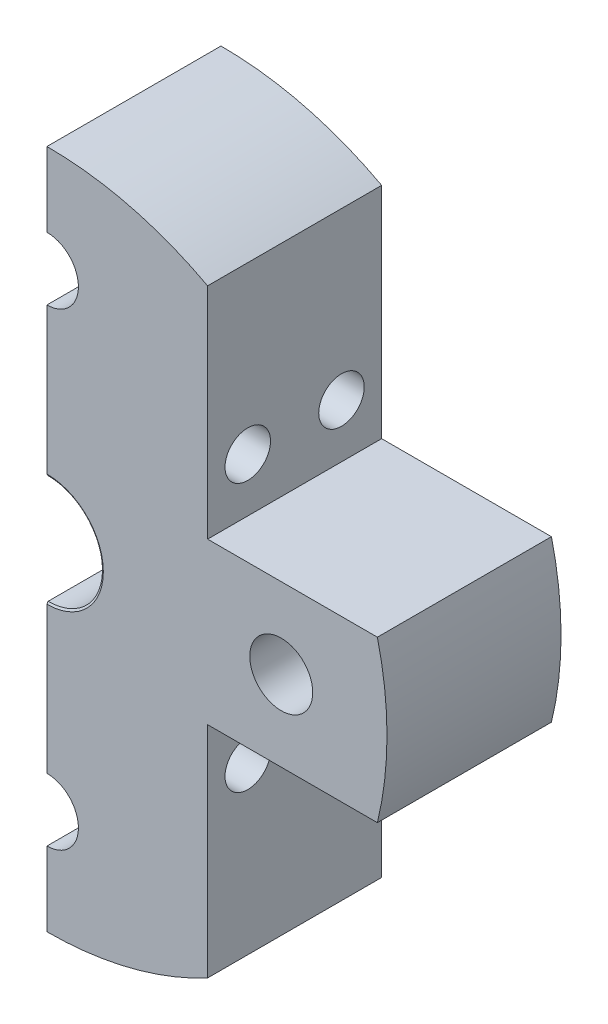
ISO-10303-21;
HEADER;
FILE_DESCRIPTION(('STEP AP214'),'2;1');
FILE_NAME('part.step','',(''),(''),'','','');
FILE_SCHEMA(('AUTOMOTIVE_DESIGN { 1 0 10303 214 1 1 1 1 }'));
ENDSEC;
DATA;
#1=APPLICATION_CONTEXT('core data for automotive mechanical design processes');
#2=APPLICATION_PROTOCOL_DEFINITION('international standard','automotive_design',2000,#1);
#3=PRODUCT_CONTEXT('',#1,'mechanical');
#4=PRODUCT('Part','Part','',(#3));
#5=PRODUCT_RELATED_PRODUCT_CATEGORY('part','',(#4));
#6=PRODUCT_DEFINITION_FORMATION('','',#4);
#7=PRODUCT_DEFINITION_CONTEXT('part definition',#1,'design');
#8=PRODUCT_DEFINITION('design','',#6,#7);
#9=PRODUCT_DEFINITION_SHAPE('','',#8);
#10=(LENGTH_UNIT() NAMED_UNIT(*) SI_UNIT(.MILLI.,.METRE.));
#11=(NAMED_UNIT(*) PLANE_ANGLE_UNIT() SI_UNIT($,.RADIAN.));
#12=(NAMED_UNIT(*) SI_UNIT($,.STERADIAN.) SOLID_ANGLE_UNIT());
#13=UNCERTAINTY_MEASURE_WITH_UNIT(LENGTH_MEASURE(1.E-05),#10,'distance_accuracy_value','');
#14=(GEOMETRIC_REPRESENTATION_CONTEXT(3) GLOBAL_UNCERTAINTY_ASSIGNED_CONTEXT((#13)) GLOBAL_UNIT_ASSIGNED_CONTEXT((#10,
#11,#12)) REPRESENTATION_CONTEXT('',''));
#15=CARTESIAN_POINT('',(0.,0.,0.));
#16=DIRECTION('',(0.,0.,1.));
#17=DIRECTION('',(1.,0.,0.));
#18=AXIS2_PLACEMENT_3D('',#15,#16,#17);
#19=CARTESIAN_POINT('',(-0.0756003290857815,0.,0.885892290730377));
#20=DIRECTION('',(0.,0.,-1.));
#21=DIRECTION('',(-1.,0.,0.));
#22=AXIS2_PLACEMENT_3D('',#19,#20,#21);
#23=CONICAL_SURFACE('',#22,4.21243556529824,1.0471975511966);
#24=CARTESIAN_POINT('',(2.5,-3.33483319222953,0.885192290730298));
#25=CARTESIAN_POINT('',(2.5,-3.24149150340867,0.927832939809622));
#26=CARTESIAN_POINT('',(2.5,-3.14790144327185,0.969938521427952));
#27=CARTESIAN_POINT('',(2.5,-2.96011744042637,1.05282281635339));
#28=CARTESIAN_POINT('',(2.5,-2.86592339838516,1.09360130433571));
#29=CARTESIAN_POINT('',(2.5,-2.67648258070487,1.17371791829645));
#30=CARTESIAN_POINT('',(2.5,-2.58123311716957,1.21304972281574));
#31=CARTESIAN_POINT('',(2.5,-2.38994857951152,1.28973772988721));
#32=CARTESIAN_POINT('',(2.5,-2.29391353975226,1.32709401832654));
#33=CARTESIAN_POINT('',(2.5,-2.00506297794883,1.43535232834615));
#34=CARTESIAN_POINT('',(2.5,-1.81088815269795,1.50270916740368));
#35=CARTESIAN_POINT('',(2.5,-1.418264065277,1.62308244680489));
#36=CARTESIAN_POINT('',(2.5,-1.21982117392264,1.6761188493723));
#37=CARTESIAN_POINT('',(2.5,-0.876433510100507,1.74904625462956));
#38=CARTESIAN_POINT('',(2.5,-0.732604931329692,1.77408674648494));
#39=CARTESIAN_POINT('',(2.5,-0.4432764944954,1.81124948288495));
#40=CARTESIAN_POINT('',(2.5,-0.297777215307146,1.82337607307082));
#41=CARTESIAN_POINT('',(2.5,-0.00639386819581579,1.83328269520408));
#42=CARTESIAN_POINT('',(2.5,0.139489766348364,1.83107493981369));
#43=CARTESIAN_POINT('',(2.5,0.430330490834044,1.81262346544898));
#44=CARTESIAN_POINT('',(2.5,0.575287515219986,1.7963787642258));
#45=CARTESIAN_POINT('',(2.5,0.945745420445522,1.73885917837197));
#46=CARTESIAN_POINT('',(2.5,1.1698356001485,1.68857795192941));
#47=CARTESIAN_POINT('',(2.5,1.50169781995441,1.59754987829245));
#48=CARTESIAN_POINT('',(2.5,1.61178017453435,1.56454035090393));
#49=CARTESIAN_POINT('',(2.5,1.83061008406208,1.49433969944479));
#50=CARTESIAN_POINT('',(2.5,1.93935774917096,1.457148923091));
#51=CARTESIAN_POINT('',(2.5,2.15721294811594,1.37887946801049));
#52=CARTESIAN_POINT('',(2.5,2.26630278242043,1.33775218038454));
#53=CARTESIAN_POINT('',(2.5,2.48342268633243,1.25277617257382));
#54=CARTESIAN_POINT('',(2.5,2.59145268108232,1.20892726173776));
#55=CARTESIAN_POINT('',(2.5,2.80581701262928,1.11939240237422));
#56=CARTESIAN_POINT('',(2.5,2.91215797176607,1.07372222106154));
#57=CARTESIAN_POINT('',(2.5,3.1240482979289,0.980655697448127));
#58=CARTESIAN_POINT('',(2.5,3.22959787405555,0.933259831993252));
#59=CARTESIAN_POINT('',(2.5,3.33483319222949,0.885192290730298));
#60=B_SPLINE_CURVE_WITH_KNOTS('',3,(#24,#25,#26,#27,#28,#29,#30,#31,#32,#33,#34,#35,#36,#37,#38,
#39,#40,#41,#42,#43,#44,#45,#46,#47,#48,#49,#50,#51,#52,#53,#54,#55,#56,#57,#58,#59),
.UNSPECIFIED.,.F.,.F.,(4,2,2,2,2,2,2,2,2,2,2,2,2,2,2,2,2,4),(0.,0.307863848235306,
0.615779698247516,0.924911079076818,1.23402900910334,1.85026041550079,2.46562832784441,
2.90312474081046,3.34047388582842,3.77745046440723,4.21445762332072,4.90171013268539,
5.24644836894447,5.5911579576048,5.94087242295461,6.29061141371449,6.63779446810295,
6.98488230531717),.UNSPECIFIED.);
#61=CARTESIAN_POINT('',(2.5,-3.33330111700141,0.885892290730377));
#62=VERTEX_POINT('',#61);
#63=CARTESIAN_POINT('',(2.5,-3.14297871370669,0.971880279447224));
#64=VERTEX_POINT('',#63);
#65=EDGE_CURVE('E62',#62,#64,#60,.T.);
#66=ORIENTED_EDGE('',*,*,#65,.F.);
#67=CARTESIAN_POINT('',(-0.0756003290857815,0.,0.885892290730377));
#68=DIRECTION('',(0.,0.,1.));
#69=DIRECTION('',(1.,0.,0.));
#70=AXIS2_PLACEMENT_3D('',#67,#68,#69);
#71=CIRCLE('',#70,4.21243556529824);
#72=CARTESIAN_POINT('',(-0.0756003290857805,-4.21243556529826,0.885892290730377));
#73=VERTEX_POINT('',#72);
#74=EDGE_CURVE('E614',#73,#62,#71,.T.);
#75=ORIENTED_EDGE('',*,*,#74,.F.);
#76=DIRECTION('',(0.,-0.866025403784441,-0.499999999999996));
#77=VECTOR('',#76,1.);
#78=CARTESIAN_POINT('',(-0.075600329085781,0.,3.31794309829924));
#79=LINE('',#78,#77);
#80=CARTESIAN_POINT('',(-0.0756003290857805,-4.06350000000002,0.971880279447225));
#81=VERTEX_POINT('',#80);
#82=EDGE_CURVE('E523',#81,#73,#79,.T.);
#83=ORIENTED_EDGE('',*,*,#82,.F.);
#84=CARTESIAN_POINT('',(-0.0756003290857815,0.,0.971880279447224));
#85=DIRECTION('',(0.,0.,-1.));
#86=DIRECTION('',(-1.,0.,0.));
#87=AXIS2_PLACEMENT_3D('',#84,#85,#86);
#88=CIRCLE('',#87,4.0635);
#89=EDGE_CURVE('E516',#64,#81,#88,.T.);
#90=ORIENTED_EDGE('',*,*,#89,.F.);
#91=EDGE_LOOP('',(#66,#75,#83,#90));
#92=FACE_BOUND('',#91,.T.);
#93=ADVANCED_FACE('F39',(#92),#23,.F.);
#94=CARTESIAN_POINT('',(-0.0756003290857815,0.,85.7279412592836));
#95=DIRECTION('',(0.,0.,-1.));
#96=DIRECTION('',(-1.,0.,0.));
#97=AXIS2_PLACEMENT_3D('',#94,#95,#96);
#98=CYLINDRICAL_SURFACE('',#97,25.4);
#99=DIRECTION('',(0.,0.,-1.));
#100=VECTOR('',#99,1.);
#101=CARTESIAN_POINT('',(-0.075600329085784,25.4,85.7279412592836));
#102=LINE('',#101,#100);
#103=CARTESIAN_POINT('',(-0.075600329085784,25.4,13.8858922907304));
#104=VERTEX_POINT('',#103);
#105=CARTESIAN_POINT('',(-0.075600329085784,25.4,0.885892290730377));
#106=VERTEX_POINT('',#105);
#107=EDGE_CURVE('E540',#104,#106,#102,.T.);
#108=ORIENTED_EDGE('',*,*,#107,.F.);
#109=CARTESIAN_POINT('',(-0.0756003290857815,0.,13.8858922907304));
#110=DIRECTION('',(0.,0.,1.));
#111=DIRECTION('',(1.,0.,0.));
#112=AXIS2_PLACEMENT_3D('',#109,#110,#111);
#113=CIRCLE('',#112,25.4);
#114=CARTESIAN_POINT('',(11.9243996709142,22.3866031366976,13.8858922907304));
#115=VERTEX_POINT('',#114);
#116=EDGE_CURVE('E612',#104,#115,#113,.F.);
#117=ORIENTED_EDGE('',*,*,#116,.T.);
#118=DIRECTION('',(0.,0.,1.));
#119=VECTOR('',#118,1.);
#120=CARTESIAN_POINT('',(11.9243996709142,22.3866031366976,0.197228590202461));
#121=LINE('',#120,#119);
#122=CARTESIAN_POINT('',(11.9243996709142,22.3866031366976,0.885892290730377));
#123=VERTEX_POINT('',#122);
#124=EDGE_CURVE('E559',#123,#115,#121,.T.);
#125=ORIENTED_EDGE('',*,*,#124,.F.);
#126=CARTESIAN_POINT('',(-0.0756003290857815,0.,0.885892290730377));
#127=DIRECTION('',(0.,0.,-1.));
#128=DIRECTION('',(-1.,0.,0.));
#129=AXIS2_PLACEMENT_3D('',#126,#127,#128);
#130=CIRCLE('',#129,25.4);
#131=EDGE_CURVE('E606',#106,#123,#130,.T.);
#132=ORIENTED_EDGE('',*,*,#131,.F.);
#133=EDGE_LOOP('',(#108,#117,#125,#132));
#134=FACE_BOUND('',#133,.T.);
#135=ADVANCED_FACE('F260',(#134),#98,.T.);
#136=DIRECTION('',(0.,0.,-1.));
#137=VECTOR('',#136,1.);
#138=CARTESIAN_POINT('',(-0.0756003290857779,-25.4,85.7279412592836));
#139=LINE('',#138,#137);
#140=CARTESIAN_POINT('',(-0.0756003290857779,-25.4,0.885892290730377));
#141=VERTEX_POINT('',#140);
#142=CARTESIAN_POINT('',(-0.0756003290857779,-25.4,13.8858922907304));
#143=VERTEX_POINT('',#142);
#144=EDGE_CURVE('E649',#141,#143,#139,.F.);
#145=ORIENTED_EDGE('',*,*,#144,.F.);
#146=CARTESIAN_POINT('',(11.9243996709142,-22.3866031366977,0.885892290730378));
#147=VERTEX_POINT('',#146);
#148=EDGE_CURVE('E609',#147,#141,#130,.T.);
#149=ORIENTED_EDGE('',*,*,#148,.F.);
#150=DIRECTION('',(0.,0.,1.));
#151=VECTOR('',#150,1.);
#152=CARTESIAN_POINT('',(11.9243996709142,-22.3866031366977,0.197228590202461));
#153=LINE('',#152,#151);
#154=CARTESIAN_POINT('',(11.9243996709142,-22.3866031366977,13.8858922907304));
#155=VERTEX_POINT('',#154);
#156=EDGE_CURVE('E543',#147,#155,#153,.T.);
#157=ORIENTED_EDGE('',*,*,#156,.T.);
#158=EDGE_CURVE('E613',#155,#143,#113,.F.);
#159=ORIENTED_EDGE('',*,*,#158,.T.);
#160=EDGE_LOOP('',(#145,#149,#157,#159));
#161=FACE_BOUND('',#160,.T.);
#162=ADVANCED_FACE('F263',(#161),#98,.T.);
#163=DIRECTION('',(0.,0.,1.));
#164=VECTOR('',#163,1.);
#165=CARTESIAN_POINT('',(24.6055665801185,-6.00000000000001,0.197228590202461));
#166=LINE('',#165,#164);
#167=CARTESIAN_POINT('',(24.6055665801185,-6.00000000000001,0.885892290730377));
#168=VERTEX_POINT('',#167);
#169=CARTESIAN_POINT('',(24.6055665801185,-6.00000000000001,13.8858922907304));
#170=VERTEX_POINT('',#169);
#171=EDGE_CURVE('E547',#168,#170,#166,.T.);
#172=ORIENTED_EDGE('',*,*,#171,.F.);
#173=CARTESIAN_POINT('',(24.6055665801185,5.99999999999998,0.885892290730378));
#174=VERTEX_POINT('',#173);
#175=EDGE_CURVE('E608',#174,#168,#130,.T.);
#176=ORIENTED_EDGE('',*,*,#175,.F.);
#177=DIRECTION('',(0.,0.,1.));
#178=VECTOR('',#177,1.);
#179=CARTESIAN_POINT('',(24.6055665801185,5.99999999999998,0.197228590202461));
#180=LINE('',#179,#178);
#181=CARTESIAN_POINT('',(24.6055665801185,5.99999999999998,13.8858922907304));
#182=VERTEX_POINT('',#181);
#183=EDGE_CURVE('E560',#174,#182,#180,.T.);
#184=ORIENTED_EDGE('',*,*,#183,.T.);
#185=EDGE_CURVE('E605',#182,#170,#113,.F.);
#186=ORIENTED_EDGE('',*,*,#185,.T.);
#187=EDGE_LOOP('',(#172,#176,#184,#186));
#188=FACE_BOUND('',#187,.T.);
#189=ADVANCED_FACE('F265',(#188),#98,.T.);
#190=CARTESIAN_POINT('',(-0.0756003290857815,0.,0.885892290730377));
#191=DIRECTION('',(0.,0.,1.));
#192=DIRECTION('',(1.,0.,0.));
#193=AXIS2_PLACEMENT_3D('',#190,#191,#192);
#194=PLANE('',#193);
#195=DIRECTION('',(0.,1.,0.));
#196=VECTOR('',#195,1.);
#197=CARTESIAN_POINT('',(2.5,4.21243556529822,0.885892290730377));
#198=LINE('',#197,#196);
#199=CARTESIAN_POINT('',(2.5,3.33330111700137,0.885892290730377));
#200=VERTEX_POINT('',#199);
#201=EDGE_CURVE('E188',#62,#200,#198,.T.);
#202=ORIENTED_EDGE('',*,*,#201,.T.);
#203=CARTESIAN_POINT('',(-0.0756003290857815,4.21243556529822,0.885892290730377));
#204=VERTEX_POINT('',#203);
#205=EDGE_CURVE('E54',#200,#204,#71,.T.);
#206=ORIENTED_EDGE('',*,*,#205,.T.);
#207=DIRECTION('',(0.,1.,0.));
#208=VECTOR('',#207,1.);
#209=CARTESIAN_POINT('',(-0.075600329085781,0.,0.885892290730377));
#210=LINE('',#209,#208);
#211=CARTESIAN_POINT('',(-0.0756003290857828,15.15,0.885892290730377));
#212=VERTEX_POINT('',#211);
#213=EDGE_CURVE('E526',#204,#212,#210,.T.);
#214=ORIENTED_EDGE('',*,*,#213,.T.);
#215=CARTESIAN_POINT('',(-0.0756003290855982,17.5,0.885892290730377));
#216=DIRECTION('',(0.,0.,1.));
#217=DIRECTION('',(1.,0.,0.));
#218=AXIS2_PLACEMENT_3D('',#215,#216,#217);
#219=CIRCLE('',#218,2.35);
#220=CARTESIAN_POINT('',(-0.0756003290857834,19.85,0.885892290730377));
#221=VERTEX_POINT('',#220);
#222=EDGE_CURVE('E591',#212,#221,#219,.T.);
#223=ORIENTED_EDGE('',*,*,#222,.T.);
#224=EDGE_CURVE('E539',#221,#106,#210,.T.);
#225=ORIENTED_EDGE('',*,*,#224,.T.);
#226=ORIENTED_EDGE('',*,*,#131,.T.);
#227=DIRECTION('',(0.,-1.,0.));
#228=VECTOR('',#227,1.);
#229=CARTESIAN_POINT('',(11.9243996709142,0.,0.885892290730377));
#230=LINE('',#229,#228);
#231=CARTESIAN_POINT('',(11.9243996709142,5.99999999999998,0.885892290730377));
#232=VERTEX_POINT('',#231);
#233=EDGE_CURVE('E578',#123,#232,#230,.T.);
#234=ORIENTED_EDGE('',*,*,#233,.T.);
#235=DIRECTION('',(1.,0.,0.));
#236=VECTOR('',#235,1.);
#237=CARTESIAN_POINT('',(-0.0756003290857823,5.99999999999998,0.885892290730377));
#238=LINE('',#237,#236);
#239=EDGE_CURVE('E581',#232,#174,#238,.T.);
#240=ORIENTED_EDGE('',*,*,#239,.T.);
#241=ORIENTED_EDGE('',*,*,#175,.T.);
#242=DIRECTION('',(-1.,0.,0.));
#243=VECTOR('',#242,1.);
#244=CARTESIAN_POINT('',(-0.0756003290857766,-6.00000000000003,0.885892290730377));
#245=LINE('',#244,#243);
#246=CARTESIAN_POINT('',(11.9243996709142,-6.00000000000002,0.885892290730377));
#247=VERTEX_POINT('',#246);
#248=EDGE_CURVE('E584',#168,#247,#245,.T.);
#249=ORIENTED_EDGE('',*,*,#248,.T.);
#250=DIRECTION('',(0.,-1.,0.));
#251=VECTOR('',#250,1.);
#252=CARTESIAN_POINT('',(11.9243996709142,0.,0.885892290730377));
#253=LINE('',#252,#251);
#254=EDGE_CURVE('E571',#247,#147,#253,.T.);
#255=ORIENTED_EDGE('',*,*,#254,.T.);
#256=ORIENTED_EDGE('',*,*,#148,.T.);
#257=CARTESIAN_POINT('',(-0.0756003290857786,-19.85,0.885892290730377));
#258=VERTEX_POINT('',#257);
#259=EDGE_CURVE('E648',#141,#258,#210,.T.);
#260=ORIENTED_EDGE('',*,*,#259,.T.);
#261=CARTESIAN_POINT('',(-0.0756003290858426,-17.5,0.885892290730377));
#262=DIRECTION('',(0.,0.,1.));
#263=DIRECTION('',(1.,0.,0.));
#264=AXIS2_PLACEMENT_3D('',#261,#262,#263);
#265=CIRCLE('',#264,2.35);
#266=CARTESIAN_POINT('',(-0.0756003290857792,-15.15,0.885892290730377));
#267=VERTEX_POINT('',#266);
#268=EDGE_CURVE('E596',#258,#267,#265,.T.);
#269=ORIENTED_EDGE('',*,*,#268,.T.);
#270=EDGE_CURVE('E528',#267,#73,#210,.T.);
#271=ORIENTED_EDGE('',*,*,#270,.T.);
#272=ORIENTED_EDGE('',*,*,#74,.T.);
#273=EDGE_LOOP('',(#202,#206,#214,#223,#225,#226,#234,#240,#241,#249,#255,#256,#260,#269,#271,#272));
#274=FACE_BOUND('',#273,.T.);
#275=CARTESIAN_POINT('',(17.4243996709142,0.,0.885892290730377));
#276=DIRECTION('',(0.,0.,1.));
#277=DIRECTION('',(1.,0.,0.));
#278=AXIS2_PLACEMENT_3D('',#275,#276,#277);
#279=CIRCLE('',#278,2.35);
#280=CARTESIAN_POINT('',(19.7743996709142,0.,0.885892290730377));
#281=VERTEX_POINT('',#280);
#282=EDGE_CURVE('E602',#281,#281,#279,.T.);
#283=ORIENTED_EDGE('',*,*,#282,.T.);
#284=EDGE_LOOP('',(#283));
#285=FACE_BOUND('',#284,.T.);
#286=ADVANCED_FACE('F266',(#274,#285),#194,.F.);
#287=CARTESIAN_POINT('',(-0.0756003290857815,0.,13.8858922907304));
#288=DIRECTION('',(0.,0.,1.));
#289=DIRECTION('',(1.,0.,0.));
#290=AXIS2_PLACEMENT_3D('',#287,#288,#289);
#291=PLANE('',#290);
#292=DIRECTION('',(0.,1.,0.));
#293=VECTOR('',#292,1.);
#294=CARTESIAN_POINT('',(-0.0756003290857919,91.5402904450258,13.8858922907304));
#295=LINE('',#294,#293);
#296=CARTESIAN_POINT('',(-0.0756003290857786,-19.85,13.8858922907304));
#297=VERTEX_POINT('',#296);
#298=EDGE_CURVE('E626',#143,#297,#295,.T.);
#299=ORIENTED_EDGE('',*,*,#298,.F.);
#300=ORIENTED_EDGE('',*,*,#158,.F.);
#301=DIRECTION('',(0.,-1.,0.));
#302=VECTOR('',#301,1.);
#303=CARTESIAN_POINT('',(11.9243996709142,-22.3866031366976,13.8858922907304));
#304=LINE('',#303,#302);
#305=CARTESIAN_POINT('',(11.9243996709142,-6.00000000000002,13.8858922907304));
#306=VERTEX_POINT('',#305);
#307=EDGE_CURVE('E552',#306,#155,#304,.T.);
#308=ORIENTED_EDGE('',*,*,#307,.F.);
#309=DIRECTION('',(-1.,0.,0.));
#310=VECTOR('',#309,1.);
#311=CARTESIAN_POINT('',(11.9243996709142,-6.00000000000002,13.8858922907304));
#312=LINE('',#311,#310);
#313=EDGE_CURVE('E546',#170,#306,#312,.T.);
#314=ORIENTED_EDGE('',*,*,#313,.F.);
#315=ORIENTED_EDGE('',*,*,#185,.F.);
#316=DIRECTION('',(1.,0.,0.));
#317=VECTOR('',#316,1.);
#318=CARTESIAN_POINT('',(11.9243996709142,5.99999999999998,13.8858922907304));
#319=LINE('',#318,#317);
#320=CARTESIAN_POINT('',(11.9243996709142,5.99999999999998,13.8858922907304));
#321=VERTEX_POINT('',#320);
#322=EDGE_CURVE('E557',#321,#182,#319,.T.);
#323=ORIENTED_EDGE('',*,*,#322,.F.);
#324=DIRECTION('',(0.,-1.,0.));
#325=VECTOR('',#324,1.);
#326=CARTESIAN_POINT('',(11.9243996709142,22.3866031366976,13.8858922907304));
#327=LINE('',#326,#325);
#328=EDGE_CURVE('E554',#115,#321,#327,.T.);
#329=ORIENTED_EDGE('',*,*,#328,.F.);
#330=ORIENTED_EDGE('',*,*,#116,.F.);
#331=CARTESIAN_POINT('',(-0.0756003290857834,19.85,13.8858922907304));
#332=VERTEX_POINT('',#331);
#333=EDGE_CURVE('E632',#332,#104,#295,.T.);
#334=ORIENTED_EDGE('',*,*,#333,.F.);
#335=CARTESIAN_POINT('',(-0.0756003290855982,17.5,13.8858922907304));
#336=DIRECTION('',(0.,0.,1.));
#337=DIRECTION('',(0.,1.,0.));
#338=AXIS2_PLACEMENT_3D('',#335,#336,#337);
#339=CIRCLE('',#338,2.35);
#340=CARTESIAN_POINT('',(-0.0756003290857828,15.15,13.8858922907304));
#341=VERTEX_POINT('',#340);
#342=EDGE_CURVE('E587',#341,#332,#339,.T.);
#343=ORIENTED_EDGE('',*,*,#342,.F.);
#344=CARTESIAN_POINT('',(-0.0756003290857815,4.21243556529821,13.8858922907304));
#345=VERTEX_POINT('',#344);
#346=EDGE_CURVE('E634',#345,#341,#295,.T.);
#347=ORIENTED_EDGE('',*,*,#346,.F.);
#348=CARTESIAN_POINT('',(-0.0756003290857815,0.,13.8858922907304));
#349=DIRECTION('',(0.,0.,1.));
#350=DIRECTION('',(1.,0.,0.));
#351=AXIS2_PLACEMENT_3D('',#348,#349,#350);
#352=CIRCLE('',#351,4.21243556529824);
#353=CARTESIAN_POINT('',(-0.0756003290857805,-4.21243556529826,13.8858922907304));
#354=VERTEX_POINT('',#353);
#355=EDGE_CURVE('E616',#345,#354,#352,.F.);
#356=ORIENTED_EDGE('',*,*,#355,.T.);
#357=CARTESIAN_POINT('',(-0.0756003290857792,-15.15,13.8858922907304));
#358=VERTEX_POINT('',#357);
#359=EDGE_CURVE('E521',#358,#354,#295,.T.);
#360=ORIENTED_EDGE('',*,*,#359,.F.);
#361=CARTESIAN_POINT('',(-0.0756003290858426,-17.5,13.8858922907304));
#362=DIRECTION('',(0.,0.,1.));
#363=DIRECTION('',(0.,-1.,0.));
#364=AXIS2_PLACEMENT_3D('',#361,#362,#363);
#365=CIRCLE('',#364,2.35);
#366=EDGE_CURVE('E588',#297,#358,#365,.T.);
#367=ORIENTED_EDGE('',*,*,#366,.F.);
#368=EDGE_LOOP('',(#299,#300,#308,#314,#315,#323,#329,#330,#334,#343,#347,#356,#360,#367));
#369=FACE_BOUND('',#368,.T.);
#370=CARTESIAN_POINT('',(17.4243996709142,0.,13.8858922907304));
#371=DIRECTION('',(0.,0.,1.));
#372=DIRECTION('',(1.,0.,0.));
#373=AXIS2_PLACEMENT_3D('',#370,#371,#372);
#374=CIRCLE('',#373,2.35);
#375=CARTESIAN_POINT('',(19.7743996709142,0.,13.8858922907304));
#376=VERTEX_POINT('',#375);
#377=EDGE_CURVE('E599',#376,#376,#374,.T.);
#378=ORIENTED_EDGE('',*,*,#377,.F.);
#379=EDGE_LOOP('',(#378));
#380=FACE_BOUND('',#379,.T.);
#381=ADVANCED_FACE('F268',(#369,#380),#291,.T.);
#382=CARTESIAN_POINT('',(2.5,3.14297871370665,0.971880279447224));
#383=VERTEX_POINT('',#382);
#384=EDGE_CURVE('E187',#383,#200,#60,.T.);
#385=ORIENTED_EDGE('',*,*,#384,.F.);
#386=CARTESIAN_POINT('',(-0.0756003290857815,4.06349999999998,0.971880279447224));
#387=VERTEX_POINT('',#386);
#388=EDGE_CURVE('E176',#387,#383,#88,.T.);
#389=ORIENTED_EDGE('',*,*,#388,.F.);
#390=DIRECTION('',(0.,-0.866025403784441,0.499999999999996));
#391=VECTOR('',#390,1.);
#392=CARTESIAN_POINT('',(-0.075600329085781,0.,3.31794309829924));
#393=LINE('',#392,#391);
#394=EDGE_CURVE('E532',#204,#387,#393,.T.);
#395=ORIENTED_EDGE('',*,*,#394,.F.);
#396=ORIENTED_EDGE('',*,*,#205,.F.);
#397=EDGE_LOOP('',(#385,#389,#395,#396));
#398=FACE_BOUND('',#397,.T.);
#399=ADVANCED_FACE('F201',(#398),#23,.F.);
#400=CARTESIAN_POINT('',(-0.0756003290857815,0.,13.1858922907304));
#401=DIRECTION('',(0.,0.,1.));
#402=DIRECTION('',(1.,0.,0.));
#403=AXIS2_PLACEMENT_3D('',#400,#401,#402);
#404=CONICAL_SURFACE('',#403,3.,1.0471975511966);
#405=CARTESIAN_POINT('',(-0.0756003290857815,0.,13.7999043020135));
#406=DIRECTION('',(0.,0.,1.));
#407=DIRECTION('',(1.,0.,0.));
#408=AXIS2_PLACEMENT_3D('',#405,#406,#407);
#409=CIRCLE('',#408,4.0635);
#410=CARTESIAN_POINT('',(-0.0756003290857805,-4.06350000000002,13.7999043020135));
#411=VERTEX_POINT('',#410);
#412=CARTESIAN_POINT('',(-0.0756003290857815,4.06349999999998,13.7999043020135));
#413=VERTEX_POINT('',#412);
#414=EDGE_CURVE('E199',#411,#413,#409,.T.);
#415=ORIENTED_EDGE('',*,*,#414,.F.);
#416=DIRECTION('',(0.,0.86602540378444,-0.499999999999997));
#417=VECTOR('',#416,1.);
#418=CARTESIAN_POINT('',(-0.075600329085781,0.,11.4538414831615));
#419=LINE('',#418,#417);
#420=EDGE_CURVE('E512',#354,#411,#419,.T.);
#421=ORIENTED_EDGE('',*,*,#420,.F.);
#422=ORIENTED_EDGE('',*,*,#355,.F.);
#423=DIRECTION('',(0.,0.86602540378444,0.499999999999997));
#424=VECTOR('',#423,1.);
#425=CARTESIAN_POINT('',(-0.075600329085781,0.,11.4538414831615));
#426=LINE('',#425,#424);
#427=EDGE_CURVE('E514',#413,#345,#426,.T.);
#428=ORIENTED_EDGE('',*,*,#427,.F.);
#429=EDGE_LOOP('',(#415,#421,#422,#428));
#430=FACE_BOUND('',#429,.T.);
#431=ADVANCED_FACE('F41',(#430),#404,.F.);
#432=CARTESIAN_POINT('',(17.4243996709142,0.,0.197228590202461));
#433=DIRECTION('',(0.,0.,1.));
#434=DIRECTION('',(1.,0.,0.));
#435=AXIS2_PLACEMENT_3D('',#432,#433,#434);
#436=CYLINDRICAL_SURFACE('',#435,2.35);
#437=ORIENTED_EDGE('',*,*,#377,.T.);
#438=EDGE_LOOP('',(#437));
#439=FACE_BOUND('',#438,.T.);
#440=ORIENTED_EDGE('',*,*,#282,.F.);
#441=EDGE_LOOP('',(#440));
#442=FACE_BOUND('',#441,.T.);
#443=ADVANCED_FACE('F255',(#439,#442),#436,.F.);
#444=CARTESIAN_POINT('',(-0.0756003290855982,17.5,0.197228590202461));
#445=DIRECTION('',(0.,0.,1.));
#446=DIRECTION('',(1.,0.,0.));
#447=AXIS2_PLACEMENT_3D('',#444,#445,#446);
#448=CYLINDRICAL_SURFACE('',#447,2.35);
#449=ORIENTED_EDGE('',*,*,#342,.T.);
#450=DIRECTION('',(0.,0.,1.));
#451=VECTOR('',#450,1.);
#452=CARTESIAN_POINT('',(-0.0756003290857834,19.85,0.197228590202461));
#453=LINE('',#452,#451);
#454=EDGE_CURVE('E536',#332,#221,#453,.F.);
#455=ORIENTED_EDGE('',*,*,#454,.T.);
#456=ORIENTED_EDGE('',*,*,#222,.F.);
#457=DIRECTION('',(0.,0.,1.));
#458=VECTOR('',#457,1.);
#459=CARTESIAN_POINT('',(-0.0756003290857828,15.15,0.197228590202461));
#460=LINE('',#459,#458);
#461=EDGE_CURVE('E522',#212,#341,#460,.T.);
#462=ORIENTED_EDGE('',*,*,#461,.T.);
#463=EDGE_LOOP('',(#449,#455,#456,#462));
#464=FACE_BOUND('',#463,.T.);
#465=ADVANCED_FACE('F251',(#464),#448,.F.);
#466=CARTESIAN_POINT('',(-0.0756003290858426,-17.5,0.197228590202461));
#467=DIRECTION('',(0.,0.,1.));
#468=DIRECTION('',(1.,0.,0.));
#469=AXIS2_PLACEMENT_3D('',#466,#467,#468);
#470=CYLINDRICAL_SURFACE('',#469,2.35);
#471=ORIENTED_EDGE('',*,*,#366,.T.);
#472=DIRECTION('',(0.,0.,1.));
#473=VECTOR('',#472,1.);
#474=CARTESIAN_POINT('',(-0.0756003290857792,-15.15,0.197228590202461));
#475=LINE('',#474,#473);
#476=EDGE_CURVE('E646',#358,#267,#475,.F.);
#477=ORIENTED_EDGE('',*,*,#476,.T.);
#478=ORIENTED_EDGE('',*,*,#268,.F.);
#479=DIRECTION('',(0.,0.,1.));
#480=VECTOR('',#479,1.);
#481=CARTESIAN_POINT('',(-0.0756003290857786,-19.85,0.197228590202461));
#482=LINE('',#481,#480);
#483=EDGE_CURVE('E652',#258,#297,#482,.T.);
#484=ORIENTED_EDGE('',*,*,#483,.T.);
#485=EDGE_LOOP('',(#471,#477,#478,#484));
#486=FACE_BOUND('',#485,.T.);
#487=ADVANCED_FACE('F224',(#486),#470,.F.);
#488=CARTESIAN_POINT('',(11.9243996709142,-6.00000000000002,0.197228590202461));
#489=DIRECTION('',(0.,1.,0.));
#490=DIRECTION('',(-1.,0.,0.));
#491=AXIS2_PLACEMENT_3D('',#488,#489,#490);
#492=PLANE('',#491);
#493=ORIENTED_EDGE('',*,*,#171,.T.);
#494=ORIENTED_EDGE('',*,*,#313,.T.);
#495=DIRECTION('',(0.,0.,1.));
#496=VECTOR('',#495,1.);
#497=CARTESIAN_POINT('',(11.9243996709142,-6.00000000000002,0.197228590202461));
#498=LINE('',#497,#496);
#499=EDGE_CURVE('E542',#247,#306,#498,.T.);
#500=ORIENTED_EDGE('',*,*,#499,.F.);
#501=ORIENTED_EDGE('',*,*,#248,.F.);
#502=EDGE_LOOP('',(#493,#494,#500,#501));
#503=FACE_BOUND('',#502,.T.);
#504=ADVANCED_FACE('F220',(#503),#492,.F.);
#505=CARTESIAN_POINT('',(11.9243996709142,-22.3866031366976,0.197228590202461));
#506=DIRECTION('',(-1.,0.,0.));
#507=DIRECTION('',(0.,-1.,0.));
#508=AXIS2_PLACEMENT_3D('',#505,#506,#507);
#509=PLANE('',#508);
#510=CARTESIAN_POINT('',(11.9243996709142,-10.,10.8858922907304));
#511=DIRECTION('',(-1.,0.,0.));
#512=DIRECTION('',(0.,-1.,0.));
#513=AXIS2_PLACEMENT_3D('',#510,#511,#512);
#514=CIRCLE('',#513,1.7);
#515=CARTESIAN_POINT('',(11.9243996709142,-11.7,10.8858922907304));
#516=VERTEX_POINT('',#515);
#517=EDGE_CURVE('E563',#516,#516,#514,.F.);
#518=ORIENTED_EDGE('',*,*,#517,.F.);
#519=EDGE_LOOP('',(#518));
#520=FACE_BOUND('',#519,.T.);
#521=CARTESIAN_POINT('',(11.9243996709142,-10.,3.88589229073038));
#522=DIRECTION('',(-1.,0.,0.));
#523=DIRECTION('',(0.,-1.,0.));
#524=AXIS2_PLACEMENT_3D('',#521,#522,#523);
#525=CIRCLE('',#524,1.7);
#526=CARTESIAN_POINT('',(11.9243996709142,-11.7,3.88589229073038));
#527=VERTEX_POINT('',#526);
#528=EDGE_CURVE('E568',#527,#527,#525,.F.);
#529=ORIENTED_EDGE('',*,*,#528,.F.);
#530=EDGE_LOOP('',(#529));
#531=FACE_BOUND('',#530,.T.);
#532=ORIENTED_EDGE('',*,*,#499,.T.);
#533=ORIENTED_EDGE('',*,*,#307,.T.);
#534=ORIENTED_EDGE('',*,*,#156,.F.);
#535=ORIENTED_EDGE('',*,*,#254,.F.);
#536=EDGE_LOOP('',(#532,#533,#534,#535));
#537=FACE_BOUND('',#536,.T.);
#538=ADVANCED_FACE('F216',(#520,#531,#537),#509,.F.);
#539=CARTESIAN_POINT('',(-25.4756003290858,-10.,3.88589229073038));
#540=DIRECTION('',(1.,0.,0.));
#541=DIRECTION('',(0.,0.,-1.));
#542=AXIS2_PLACEMENT_3D('',#539,#540,#541);
#543=CYLINDRICAL_SURFACE('',#542,1.7);
#544=CARTESIAN_POINT('',(-0.075600329085778,-10.,3.88589229073038));
#545=DIRECTION('',(1.,0.,0.));
#546=DIRECTION('',(0.,1.,0.));
#547=AXIS2_PLACEMENT_3D('',#544,#545,#546);
#548=CIRCLE('',#547,1.7);
#549=CARTESIAN_POINT('',(-0.0756003290857783,-8.30000000000002,3.88589229073038));
#550=VERTEX_POINT('',#549);
#551=EDGE_CURVE('E675',#550,#550,#548,.F.);
#552=ORIENTED_EDGE('',*,*,#551,.T.);
#553=EDGE_LOOP('',(#552));
#554=FACE_BOUND('',#553,.T.);
#555=ORIENTED_EDGE('',*,*,#528,.T.);
#556=EDGE_LOOP('',(#555));
#557=FACE_BOUND('',#556,.T.);
#558=ADVANCED_FACE('F219',(#554,#557),#543,.F.);
#559=CARTESIAN_POINT('',(11.9243996709142,5.99999999999998,0.197228590202461));
#560=DIRECTION('',(0.,-1.,0.));
#561=DIRECTION('',(1.,0.,0.));
#562=AXIS2_PLACEMENT_3D('',#559,#560,#561);
#563=PLANE('',#562);
#564=DIRECTION('',(0.,0.,1.));
#565=VECTOR('',#564,1.);
#566=CARTESIAN_POINT('',(11.9243996709142,5.99999999999998,0.197228590202461));
#567=LINE('',#566,#565);
#568=EDGE_CURVE('E564',#232,#321,#567,.T.);
#569=ORIENTED_EDGE('',*,*,#568,.T.);
#570=ORIENTED_EDGE('',*,*,#322,.T.);
#571=ORIENTED_EDGE('',*,*,#183,.F.);
#572=ORIENTED_EDGE('',*,*,#239,.F.);
#573=EDGE_LOOP('',(#569,#570,#571,#572));
#574=FACE_BOUND('',#573,.T.);
#575=ADVANCED_FACE('F226',(#574),#563,.F.);
#576=CARTESIAN_POINT('',(11.9243996709142,22.3866031366976,0.197228590202461));
#577=DIRECTION('',(-1.,0.,0.));
#578=DIRECTION('',(0.,-1.,0.));
#579=AXIS2_PLACEMENT_3D('',#576,#577,#578);
#580=PLANE('',#579);
#581=CARTESIAN_POINT('',(11.9243996709142,9.99999999999998,3.88589229073038));
#582=DIRECTION('',(-1.,0.,0.));
#583=DIRECTION('',(0.,-1.,0.));
#584=AXIS2_PLACEMENT_3D('',#581,#582,#583);
#585=CIRCLE('',#584,1.7);
#586=CARTESIAN_POINT('',(11.9243996709142,8.29999999999998,3.88589229073038));
#587=VERTEX_POINT('',#586);
#588=EDGE_CURVE('E574',#587,#587,#585,.F.);
#589=ORIENTED_EDGE('',*,*,#588,.F.);
#590=EDGE_LOOP('',(#589));
#591=FACE_BOUND('',#590,.T.);
#592=CARTESIAN_POINT('',(11.9243996709142,9.99999999999998,10.8858922907304));
#593=DIRECTION('',(-1.,0.,0.));
#594=DIRECTION('',(0.,-1.,0.));
#595=AXIS2_PLACEMENT_3D('',#592,#593,#594);
#596=CIRCLE('',#595,1.7);
#597=CARTESIAN_POINT('',(11.9243996709142,8.29999999999998,10.8858922907304));
#598=VERTEX_POINT('',#597);
#599=EDGE_CURVE('E575',#598,#598,#596,.F.);
#600=ORIENTED_EDGE('',*,*,#599,.F.);
#601=EDGE_LOOP('',(#600));
#602=FACE_BOUND('',#601,.T.);
#603=ORIENTED_EDGE('',*,*,#124,.T.);
#604=ORIENTED_EDGE('',*,*,#328,.T.);
#605=ORIENTED_EDGE('',*,*,#568,.F.);
#606=ORIENTED_EDGE('',*,*,#233,.F.);
#607=EDGE_LOOP('',(#603,#604,#605,#606));
#608=FACE_BOUND('',#607,.T.);
#609=ADVANCED_FACE('F229',(#591,#602,#608),#580,.F.);
#610=CARTESIAN_POINT('',(-25.4756003290858,9.99999999999998,10.8858922907304));
#611=DIRECTION('',(1.,0.,0.));
#612=DIRECTION('',(0.,0.,-1.));
#613=AXIS2_PLACEMENT_3D('',#610,#611,#612);
#614=CYLINDRICAL_SURFACE('',#613,1.7);
#615=CARTESIAN_POINT('',(-0.0756003290857815,9.99999999999998,10.8858922907304));
#616=DIRECTION('',(1.,0.,0.));
#617=DIRECTION('',(0.,1.,0.));
#618=AXIS2_PLACEMENT_3D('',#615,#616,#617);
#619=CIRCLE('',#618,1.7);
#620=CARTESIAN_POINT('',(-0.0756003290857817,11.7,10.8858922907304));
#621=VERTEX_POINT('',#620);
#622=EDGE_CURVE('E629',#621,#621,#619,.F.);
#623=ORIENTED_EDGE('',*,*,#622,.T.);
#624=EDGE_LOOP('',(#623));
#625=FACE_BOUND('',#624,.T.);
#626=ORIENTED_EDGE('',*,*,#599,.T.);
#627=EDGE_LOOP('',(#626));
#628=FACE_BOUND('',#627,.T.);
#629=ADVANCED_FACE('F233',(#625,#628),#614,.F.);
#630=CARTESIAN_POINT('',(-25.4756003290858,-10.,10.8858922907304));
#631=DIRECTION('',(1.,0.,0.));
#632=DIRECTION('',(0.,0.,-1.));
#633=AXIS2_PLACEMENT_3D('',#630,#631,#632);
#634=CYLINDRICAL_SURFACE('',#633,1.7);
#635=CARTESIAN_POINT('',(-0.075600329085778,-10.,10.8858922907304));
#636=DIRECTION('',(1.,0.,0.));
#637=DIRECTION('',(0.,1.,0.));
#638=AXIS2_PLACEMENT_3D('',#635,#636,#637);
#639=CIRCLE('',#638,1.7);
#640=CARTESIAN_POINT('',(-0.0756003290857783,-8.30000000000002,10.8858922907304));
#641=VERTEX_POINT('',#640);
#642=EDGE_CURVE('E625',#641,#641,#639,.F.);
#643=ORIENTED_EDGE('',*,*,#642,.T.);
#644=EDGE_LOOP('',(#643));
#645=FACE_BOUND('',#644,.T.);
#646=ORIENTED_EDGE('',*,*,#517,.T.);
#647=EDGE_LOOP('',(#646));
#648=FACE_BOUND('',#647,.T.);
#649=ADVANCED_FACE('F238',(#645,#648),#634,.F.);
#650=CARTESIAN_POINT('',(-25.4756003290858,9.99999999999998,3.88589229073038));
#651=DIRECTION('',(1.,0.,0.));
#652=DIRECTION('',(0.,0.,-1.));
#653=AXIS2_PLACEMENT_3D('',#650,#651,#652);
#654=CYLINDRICAL_SURFACE('',#653,1.7);
#655=CARTESIAN_POINT('',(-0.0756003290857815,9.99999999999998,3.88589229073038));
#656=DIRECTION('',(1.,0.,0.));
#657=DIRECTION('',(0.,1.,0.));
#658=AXIS2_PLACEMENT_3D('',#655,#656,#657);
#659=CIRCLE('',#658,1.7);
#660=CARTESIAN_POINT('',(-0.0756003290857817,11.7,3.88589229073038));
#661=VERTEX_POINT('',#660);
#662=EDGE_CURVE('E622',#661,#661,#659,.F.);
#663=ORIENTED_EDGE('',*,*,#662,.T.);
#664=EDGE_LOOP('',(#663));
#665=FACE_BOUND('',#664,.T.);
#666=ORIENTED_EDGE('',*,*,#588,.T.);
#667=EDGE_LOOP('',(#666));
#668=FACE_BOUND('',#667,.T.);
#669=ADVANCED_FACE('F235',(#665,#668),#654,.F.);
#670=CARTESIAN_POINT('',(-0.0756003290857919,91.5402904450258,0.197228590202461));
#671=DIRECTION('',(1.,0.,0.));
#672=DIRECTION('',(0.,1.,0.));
#673=AXIS2_PLACEMENT_3D('',#670,#671,#672);
#674=PLANE('',#673);
#675=ORIENTED_EDGE('',*,*,#394,.T.);
#676=DIRECTION('',(0.,0.,1.));
#677=VECTOR('',#676,1.);
#678=CARTESIAN_POINT('',(-0.0756003290857815,4.06349999999998,0.260741980803794));
#679=LINE('',#678,#677);
#680=EDGE_CURVE('E636',#387,#413,#679,.T.);
#681=ORIENTED_EDGE('',*,*,#680,.T.);
#682=ORIENTED_EDGE('',*,*,#427,.T.);
#683=ORIENTED_EDGE('',*,*,#346,.T.);
#684=ORIENTED_EDGE('',*,*,#461,.F.);
#685=ORIENTED_EDGE('',*,*,#213,.F.);
#686=EDGE_LOOP('',(#675,#681,#682,#683,#684,#685));
#687=FACE_BOUND('',#686,.T.);
#688=ORIENTED_EDGE('',*,*,#662,.F.);
#689=EDGE_LOOP('',(#688));
#690=FACE_BOUND('',#689,.T.);
#691=ORIENTED_EDGE('',*,*,#622,.F.);
#692=EDGE_LOOP('',(#691));
#693=FACE_BOUND('',#692,.T.);
#694=ADVANCED_FACE('F215',(#687,#690,#693),#674,.F.);
#695=ORIENTED_EDGE('',*,*,#420,.T.);
#696=DIRECTION('',(0.,0.,1.));
#697=VECTOR('',#696,1.);
#698=CARTESIAN_POINT('',(-0.0756003290857805,-4.06350000000002,0.260741980803794));
#699=LINE('',#698,#697);
#700=EDGE_CURVE('E183',#411,#81,#699,.F.);
#701=ORIENTED_EDGE('',*,*,#700,.T.);
#702=ORIENTED_EDGE('',*,*,#82,.T.);
#703=ORIENTED_EDGE('',*,*,#270,.F.);
#704=ORIENTED_EDGE('',*,*,#476,.F.);
#705=ORIENTED_EDGE('',*,*,#359,.T.);
#706=EDGE_LOOP('',(#695,#701,#702,#703,#704,#705));
#707=FACE_BOUND('',#706,.T.);
#708=ORIENTED_EDGE('',*,*,#642,.F.);
#709=EDGE_LOOP('',(#708));
#710=FACE_BOUND('',#709,.T.);
#711=ORIENTED_EDGE('',*,*,#551,.F.);
#712=EDGE_LOOP('',(#711));
#713=FACE_BOUND('',#712,.T.);
#714=ADVANCED_FACE('F358',(#707,#710,#713),#674,.F.);
#715=ORIENTED_EDGE('',*,*,#144,.T.);
#716=ORIENTED_EDGE('',*,*,#298,.T.);
#717=ORIENTED_EDGE('',*,*,#483,.F.);
#718=ORIENTED_EDGE('',*,*,#259,.F.);
#719=EDGE_LOOP('',(#715,#716,#717,#718));
#720=FACE_BOUND('',#719,.T.);
#721=ADVANCED_FACE('F213',(#720),#674,.F.);
#722=ORIENTED_EDGE('',*,*,#107,.T.);
#723=ORIENTED_EDGE('',*,*,#224,.F.);
#724=ORIENTED_EDGE('',*,*,#454,.F.);
#725=ORIENTED_EDGE('',*,*,#333,.T.);
#726=EDGE_LOOP('',(#722,#723,#724,#725));
#727=FACE_BOUND('',#726,.T.);
#728=ADVANCED_FACE('F210',(#727),#674,.F.);
#729=CARTESIAN_POINT('',(-0.0756003290857815,0.,0.260741980803794));
#730=DIRECTION('',(0.,0.,1.));
#731=DIRECTION('',(1.,0.,0.));
#732=AXIS2_PLACEMENT_3D('',#729,#730,#731);
#733=CYLINDRICAL_SURFACE('',#732,4.0635);
#734=CARTESIAN_POINT('',(-0.0756003290857815,0.,8.88589229073038));
#735=DIRECTION('',(0.,0.,-1.));
#736=DIRECTION('',(-1.,0.,0.));
#737=AXIS2_PLACEMENT_3D('',#734,#735,#736);
#738=CIRCLE('',#737,4.0635);
#739=CARTESIAN_POINT('',(2.5,-3.14297871370669,8.88589229073038));
#740=VERTEX_POINT('',#739);
#741=CARTESIAN_POINT('',(2.5,3.14297871370665,8.88589229073038));
#742=VERTEX_POINT('',#741);
#743=EDGE_CURVE('E173',#740,#742,#738,.F.);
#744=ORIENTED_EDGE('',*,*,#743,.F.);
#745=DIRECTION('',(0.,0.,1.));
#746=VECTOR('',#745,1.);
#747=CARTESIAN_POINT('',(2.5,-3.14297871370669,0.260741980803794));
#748=LINE('',#747,#746);
#749=EDGE_CURVE('E11',#740,#64,#748,.F.);
#750=ORIENTED_EDGE('',*,*,#749,.T.);
#751=ORIENTED_EDGE('',*,*,#89,.T.);
#752=ORIENTED_EDGE('',*,*,#700,.F.);
#753=ORIENTED_EDGE('',*,*,#414,.T.);
#754=ORIENTED_EDGE('',*,*,#680,.F.);
#755=ORIENTED_EDGE('',*,*,#388,.T.);
#756=DIRECTION('',(0.,0.,1.));
#757=VECTOR('',#756,1.);
#758=CARTESIAN_POINT('',(2.5,3.14297871370665,0.260741980803794));
#759=LINE('',#758,#757);
#760=EDGE_CURVE('E47',#383,#742,#759,.T.);
#761=ORIENTED_EDGE('',*,*,#760,.T.);
#762=EDGE_LOOP('',(#744,#750,#751,#752,#753,#754,#755,#761));
#763=FACE_BOUND('',#762,.T.);
#764=ADVANCED_FACE('F172',(#763),#733,.F.);
#765=CARTESIAN_POINT('',(0.,0.,8.88589229073038));
#766=DIRECTION('',(0.,0.,-1.));
#767=DIRECTION('',(-1.,0.,0.));
#768=AXIS2_PLACEMENT_3D('',#765,#766,#767);
#769=PLANE('',#768);
#770=DIRECTION('',(0.,1.,0.));
#771=VECTOR('',#770,1.);
#772=CARTESIAN_POINT('',(2.5,4.21243556529822,8.88589229073038));
#773=LINE('',#772,#771);
#774=EDGE_CURVE('E182',#740,#742,#773,.T.);
#775=ORIENTED_EDGE('',*,*,#774,.F.);
#776=ORIENTED_EDGE('',*,*,#743,.T.);
#777=EDGE_LOOP('',(#775,#776));
#778=FACE_BOUND('',#777,.T.);
#779=ADVANCED_FACE('F181',(#778),#769,.F.);
#780=CARTESIAN_POINT('',(2.5,4.21243556529822,8.88589229073038));
#781=DIRECTION('',(-1.,0.,0.));
#782=DIRECTION('',(0.,-1.,0.));
#783=AXIS2_PLACEMENT_3D('',#780,#781,#782);
#784=PLANE('',#783);
#785=ORIENTED_EDGE('',*,*,#201,.F.);
#786=ORIENTED_EDGE('',*,*,#65,.T.);
#787=ORIENTED_EDGE('',*,*,#749,.F.);
#788=ORIENTED_EDGE('',*,*,#774,.T.);
#789=ORIENTED_EDGE('',*,*,#760,.F.);
#790=ORIENTED_EDGE('',*,*,#384,.T.);
#791=EDGE_LOOP('',(#785,#786,#787,#788,#789,#790));
#792=FACE_BOUND('',#791,.T.);
#793=ADVANCED_FACE('F186',(#792),#784,.T.);
#794=CLOSED_SHELL('',(#93,#135,#162,#189,#286,#381,#399,#431,#443,#465,#487,#504,#538,#558,#575,
#609,#629,#649,#669,#694,#714,#721,#728,#764,#779,#793));
#795=MANIFOLD_SOLID_BREP('B2',#794);
#796=ADVANCED_BREP_SHAPE_REPRESENTATION('',(#18,#795),#14);
#797=SHAPE_DEFINITION_REPRESENTATION(#9,#796);
ENDSEC;
END-ISO-10303-21;
